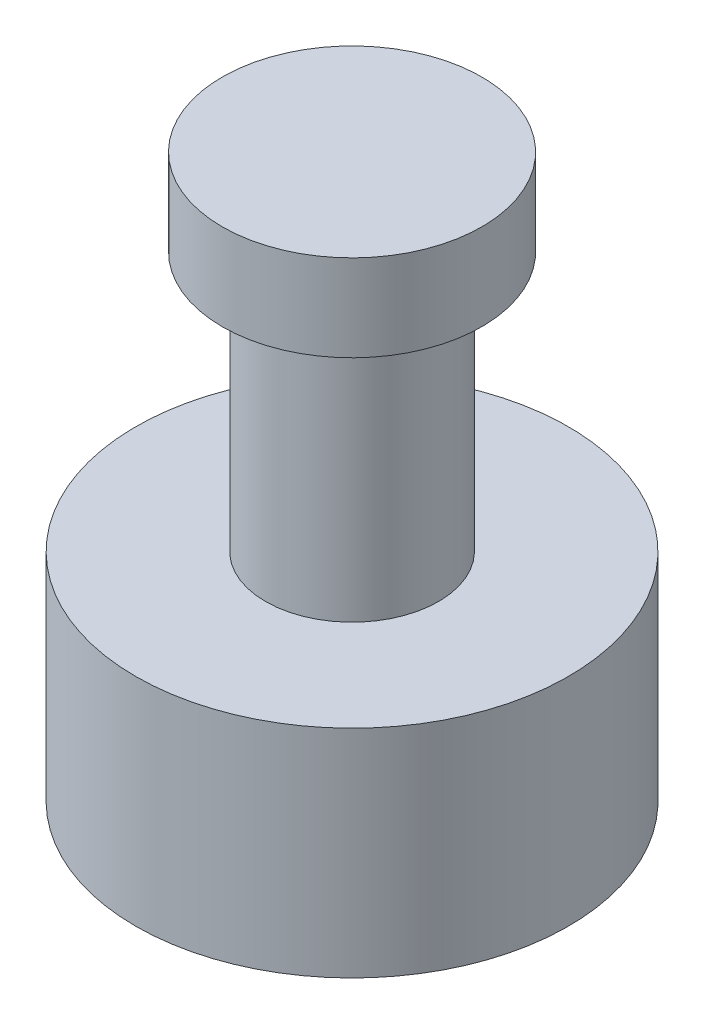
ISO-10303-21;
HEADER;
FILE_DESCRIPTION(('STEP AP214'),'2;1');
FILE_NAME('part.step','',(''),(''),'','','');
FILE_SCHEMA(('AUTOMOTIVE_DESIGN { 1 0 10303 214 1 1 1 1 }'));
ENDSEC;
DATA;
#1=APPLICATION_CONTEXT('core data for automotive mechanical design processes');
#2=APPLICATION_PROTOCOL_DEFINITION('international standard','automotive_design',2000,#1);
#3=PRODUCT_CONTEXT('',#1,'mechanical');
#4=PRODUCT('Part','Part','',(#3));
#5=PRODUCT_RELATED_PRODUCT_CATEGORY('part','',(#4));
#6=PRODUCT_DEFINITION_FORMATION('','',#4);
#7=PRODUCT_DEFINITION_CONTEXT('part definition',#1,'design');
#8=PRODUCT_DEFINITION('design','',#6,#7);
#9=PRODUCT_DEFINITION_SHAPE('','',#8);
#10=(LENGTH_UNIT() NAMED_UNIT(*) SI_UNIT(.MILLI.,.METRE.));
#11=(NAMED_UNIT(*) PLANE_ANGLE_UNIT() SI_UNIT($,.RADIAN.));
#12=(NAMED_UNIT(*) SI_UNIT($,.STERADIAN.) SOLID_ANGLE_UNIT());
#13=UNCERTAINTY_MEASURE_WITH_UNIT(LENGTH_MEASURE(1.E-05),#10,'distance_accuracy_value','');
#14=(GEOMETRIC_REPRESENTATION_CONTEXT(3) GLOBAL_UNCERTAINTY_ASSIGNED_CONTEXT((#13)) GLOBAL_UNIT_ASSIGNED_CONTEXT((#10,
#11,#12)) REPRESENTATION_CONTEXT('',''));
#15=CARTESIAN_POINT('',(0.,0.,0.));
#16=DIRECTION('',(0.,0.,1.));
#17=DIRECTION('',(1.,0.,0.));
#18=AXIS2_PLACEMENT_3D('',#15,#16,#17);
#19=CARTESIAN_POINT('',(0.,5.,0.));
#20=DIRECTION('',(0.,1.,0.));
#21=DIRECTION('',(0.,0.,1.));
#22=AXIS2_PLACEMENT_3D('',#19,#20,#21);
#23=PLANE('',#22);
#24=CARTESIAN_POINT('',(0.,5.,0.));
#25=DIRECTION('',(0.,1.,0.));
#26=DIRECTION('',(0.,0.,1.));
#27=AXIS2_PLACEMENT_3D('',#24,#25,#26);
#28=CIRCLE('',#27,5.);
#29=CARTESIAN_POINT('',(0.,5.,5.));
#30=VERTEX_POINT('',#29);
#31=EDGE_CURVE('E9',#30,#30,#28,.T.);
#32=ORIENTED_EDGE('',*,*,#31,.T.);
#33=EDGE_LOOP('',(#32));
#34=FACE_BOUND('',#33,.T.);
#35=CARTESIAN_POINT('',(0.,5.,0.));
#36=DIRECTION('',(0.,1.,0.));
#37=DIRECTION('',(0.,0.,1.));
#38=AXIS2_PLACEMENT_3D('',#35,#36,#37);
#39=CIRCLE('',#38,2.);
#40=CARTESIAN_POINT('',(0.,5.,2.));
#41=VERTEX_POINT('',#40);
#42=EDGE_CURVE('E26',#41,#41,#39,.T.);
#43=ORIENTED_EDGE('',*,*,#42,.F.);
#44=EDGE_LOOP('',(#43));
#45=FACE_BOUND('',#44,.T.);
#46=ADVANCED_FACE('F13',(#34,#45),#23,.T.);
#47=CARTESIAN_POINT('',(0.,5.,0.));
#48=DIRECTION('',(0.,-1.,0.));
#49=DIRECTION('',(0.,0.,-1.));
#50=AXIS2_PLACEMENT_3D('',#47,#48,#49);
#51=CYLINDRICAL_SURFACE('',#50,5.);
#52=ORIENTED_EDGE('',*,*,#31,.F.);
#53=EDGE_LOOP('',(#52));
#54=FACE_BOUND('',#53,.T.);
#55=CARTESIAN_POINT('',(0.,0.,0.));
#56=DIRECTION('',(0.,1.,0.));
#57=DIRECTION('',(0.,0.,1.));
#58=AXIS2_PLACEMENT_3D('',#55,#56,#57);
#59=CIRCLE('',#58,5.);
#60=CARTESIAN_POINT('',(0.,0.,5.));
#61=VERTEX_POINT('',#60);
#62=EDGE_CURVE('E17',#61,#61,#59,.T.);
#63=ORIENTED_EDGE('',*,*,#62,.T.);
#64=EDGE_LOOP('',(#63));
#65=FACE_BOUND('',#64,.T.);
#66=ADVANCED_FACE('F15',(#54,#65),#51,.T.);
#67=CARTESIAN_POINT('',(0.,0.,0.));
#68=DIRECTION('',(0.,1.,0.));
#69=DIRECTION('',(0.,0.,1.));
#70=AXIS2_PLACEMENT_3D('',#67,#68,#69);
#71=PLANE('',#70);
#72=ORIENTED_EDGE('',*,*,#62,.F.);
#73=EDGE_LOOP('',(#72));
#74=FACE_BOUND('',#73,.T.);
#75=ADVANCED_FACE('F55',(#74),#71,.F.);
#76=CARTESIAN_POINT('',(0.,11.,0.));
#77=DIRECTION('',(0.,-1.,0.));
#78=DIRECTION('',(0.,0.,-1.));
#79=AXIS2_PLACEMENT_3D('',#76,#77,#78);
#80=CYLINDRICAL_SURFACE('',#79,2.);
#81=CARTESIAN_POINT('',(0.,11.,0.));
#82=DIRECTION('',(0.,1.,0.));
#83=DIRECTION('',(0.,0.,1.));
#84=AXIS2_PLACEMENT_3D('',#81,#82,#83);
#85=CIRCLE('',#84,2.);
#86=CARTESIAN_POINT('',(0.,11.,2.));
#87=VERTEX_POINT('',#86);
#88=EDGE_CURVE('E24',#87,#87,#85,.T.);
#89=ORIENTED_EDGE('',*,*,#88,.F.);
#90=EDGE_LOOP('',(#89));
#91=FACE_BOUND('',#90,.T.);
#92=ORIENTED_EDGE('',*,*,#42,.T.);
#93=EDGE_LOOP('',(#92));
#94=FACE_BOUND('',#93,.T.);
#95=ADVANCED_FACE('F49',(#91,#94),#80,.T.);
#96=CARTESIAN_POINT('',(0.,11.,0.));
#97=DIRECTION('',(0.,1.,0.));
#98=DIRECTION('',(0.,0.,1.));
#99=AXIS2_PLACEMENT_3D('',#96,#97,#98);
#100=PLANE('',#99);
#101=CARTESIAN_POINT('',(0.,11.,0.));
#102=DIRECTION('',(0.,1.,0.));
#103=DIRECTION('',(0.,0.,1.));
#104=AXIS2_PLACEMENT_3D('',#101,#102,#103);
#105=CIRCLE('',#104,3.);
#106=CARTESIAN_POINT('',(0.,11.,3.));
#107=VERTEX_POINT('',#106);
#108=EDGE_CURVE('E32',#107,#107,#105,.T.);
#109=ORIENTED_EDGE('',*,*,#108,.F.);
#110=EDGE_LOOP('',(#109));
#111=FACE_BOUND('',#110,.T.);
#112=ORIENTED_EDGE('',*,*,#88,.T.);
#113=EDGE_LOOP('',(#112));
#114=FACE_BOUND('',#113,.T.);
#115=ADVANCED_FACE('F43',(#111,#114),#100,.F.);
#116=CARTESIAN_POINT('',(0.,13.,0.));
#117=DIRECTION('',(0.,-1.,0.));
#118=DIRECTION('',(0.,0.,-1.));
#119=AXIS2_PLACEMENT_3D('',#116,#117,#118);
#120=CYLINDRICAL_SURFACE('',#119,3.);
#121=CARTESIAN_POINT('',(0.,13.,0.));
#122=DIRECTION('',(0.,1.,0.));
#123=DIRECTION('',(0.,0.,1.));
#124=AXIS2_PLACEMENT_3D('',#121,#122,#123);
#125=CIRCLE('',#124,3.);
#126=CARTESIAN_POINT('',(0.,13.,3.));
#127=VERTEX_POINT('',#126);
#128=EDGE_CURVE('E29',#127,#127,#125,.T.);
#129=ORIENTED_EDGE('',*,*,#128,.F.);
#130=EDGE_LOOP('',(#129));
#131=FACE_BOUND('',#130,.T.);
#132=ORIENTED_EDGE('',*,*,#108,.T.);
#133=EDGE_LOOP('',(#132));
#134=FACE_BOUND('',#133,.T.);
#135=ADVANCED_FACE('F40',(#131,#134),#120,.T.);
#136=CARTESIAN_POINT('',(0.,13.,0.));
#137=DIRECTION('',(0.,1.,0.));
#138=DIRECTION('',(0.,0.,1.));
#139=AXIS2_PLACEMENT_3D('',#136,#137,#138);
#140=PLANE('',#139);
#141=ORIENTED_EDGE('',*,*,#128,.T.);
#142=EDGE_LOOP('',(#141));
#143=FACE_BOUND('',#142,.T.);
#144=ADVANCED_FACE('F38',(#143),#140,.T.);
#145=CLOSED_SHELL('',(#46,#66,#75,#95,#115,#135,#144));
#146=MANIFOLD_SOLID_BREP('B1',#145);
#147=ADVANCED_BREP_SHAPE_REPRESENTATION('',(#18,#146),#14);
#148=SHAPE_DEFINITION_REPRESENTATION(#9,#147);
ENDSEC;
END-ISO-10303-21;
